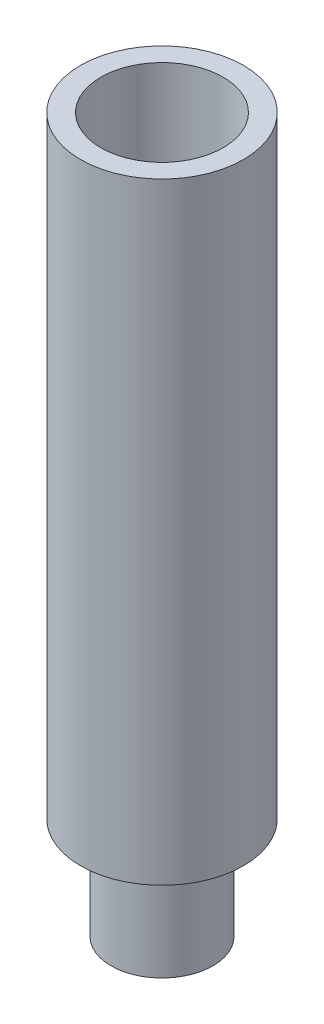
ISO-10303-21;
HEADER;
FILE_DESCRIPTION(('STEP AP214'),'2;1');
FILE_NAME('part.step','',(''),(''),'','','');
FILE_SCHEMA(('AUTOMOTIVE_DESIGN { 1 0 10303 214 1 1 1 1 }'));
ENDSEC;
DATA;
#1=APPLICATION_CONTEXT('core data for automotive mechanical design processes');
#2=APPLICATION_PROTOCOL_DEFINITION('international standard','automotive_design',2000,#1);
#3=PRODUCT_CONTEXT('',#1,'mechanical');
#4=PRODUCT('Part','Part','',(#3));
#5=PRODUCT_RELATED_PRODUCT_CATEGORY('part','',(#4));
#6=PRODUCT_DEFINITION_FORMATION('','',#4);
#7=PRODUCT_DEFINITION_CONTEXT('part definition',#1,'design');
#8=PRODUCT_DEFINITION('design','',#6,#7);
#9=PRODUCT_DEFINITION_SHAPE('','',#8);
#10=(LENGTH_UNIT() NAMED_UNIT(*) SI_UNIT(.MILLI.,.METRE.));
#11=(NAMED_UNIT(*) PLANE_ANGLE_UNIT() SI_UNIT($,.RADIAN.));
#12=(NAMED_UNIT(*) SI_UNIT($,.STERADIAN.) SOLID_ANGLE_UNIT());
#13=UNCERTAINTY_MEASURE_WITH_UNIT(LENGTH_MEASURE(1.E-05),#10,'distance_accuracy_value','');
#14=(GEOMETRIC_REPRESENTATION_CONTEXT(3) GLOBAL_UNCERTAINTY_ASSIGNED_CONTEXT((#13)) GLOBAL_UNIT_ASSIGNED_CONTEXT((#10,
#11,#12)) REPRESENTATION_CONTEXT('',''));
#15=CARTESIAN_POINT('',(0.,0.,0.));
#16=DIRECTION('',(0.,0.,1.));
#17=DIRECTION('',(1.,0.,0.));
#18=AXIS2_PLACEMENT_3D('',#15,#16,#17);
#19=CARTESIAN_POINT('',(0.,5.,0.));
#20=DIRECTION('',(0.,-1.,0.));
#21=DIRECTION('',(0.,0.,-1.));
#22=AXIS2_PLACEMENT_3D('',#19,#20,#21);
#23=CYLINDRICAL_SURFACE('',#22,2.5);
#24=CARTESIAN_POINT('',(0.,5.,0.));
#25=DIRECTION('',(0.,1.,0.));
#26=DIRECTION('',(0.,0.,1.));
#27=AXIS2_PLACEMENT_3D('',#24,#25,#26);
#28=CIRCLE('',#27,2.5);
#29=CARTESIAN_POINT('',(0.,5.,2.5));
#30=VERTEX_POINT('',#29);
#31=EDGE_CURVE('E54',#30,#30,#28,.T.);
#32=ORIENTED_EDGE('',*,*,#31,.F.);
#33=EDGE_LOOP('',(#32));
#34=FACE_BOUND('',#33,.T.);
#35=CARTESIAN_POINT('',(0.,0.,0.));
#36=DIRECTION('',(0.,1.,0.));
#37=DIRECTION('',(0.,0.,1.));
#38=AXIS2_PLACEMENT_3D('',#35,#36,#37);
#39=CIRCLE('',#38,2.5);
#40=CARTESIAN_POINT('',(0.,0.,2.5));
#41=VERTEX_POINT('',#40);
#42=EDGE_CURVE('E61',#41,#41,#39,.T.);
#43=ORIENTED_EDGE('',*,*,#42,.T.);
#44=EDGE_LOOP('',(#43));
#45=FACE_BOUND('',#44,.T.);
#46=ADVANCED_FACE('F47',(#34,#45),#23,.T.);
#47=CARTESIAN_POINT('',(0.,0.,0.));
#48=DIRECTION('',(0.,1.,0.));
#49=DIRECTION('',(0.,0.,1.));
#50=AXIS2_PLACEMENT_3D('',#47,#48,#49);
#51=PLANE('',#50);
#52=ORIENTED_EDGE('',*,*,#42,.F.);
#53=EDGE_LOOP('',(#52));
#54=FACE_BOUND('',#53,.T.);
#55=ADVANCED_FACE('F99',(#54),#51,.F.);
#56=CARTESIAN_POINT('',(0.,6.,0.));
#57=DIRECTION('',(0.,-1.,0.));
#58=DIRECTION('',(0.,0.,-1.));
#59=AXIS2_PLACEMENT_3D('',#56,#57,#58);
#60=CYLINDRICAL_SURFACE('',#59,4.);
#61=CARTESIAN_POINT('',(0.,5.,0.));
#62=DIRECTION('',(0.,1.,0.));
#63=DIRECTION('',(0.,0.,1.));
#64=AXIS2_PLACEMENT_3D('',#61,#62,#63);
#65=CIRCLE('',#64,4.);
#66=CARTESIAN_POINT('',(0.,5.,4.));
#67=VERTEX_POINT('',#66);
#68=EDGE_CURVE('E68',#67,#67,#65,.T.);
#69=ORIENTED_EDGE('',*,*,#68,.T.);
#70=EDGE_LOOP('',(#69));
#71=FACE_BOUND('',#70,.T.);
#72=CARTESIAN_POINT('',(0.,35.,0.));
#73=DIRECTION('',(0.,1.,0.));
#74=DIRECTION('',(0.,0.,1.));
#75=AXIS2_PLACEMENT_3D('',#72,#73,#74);
#76=CIRCLE('',#75,4.);
#77=CARTESIAN_POINT('',(0.,35.,4.));
#78=VERTEX_POINT('',#77);
#79=EDGE_CURVE('E73',#78,#78,#76,.T.);
#80=ORIENTED_EDGE('',*,*,#79,.F.);
#81=EDGE_LOOP('',(#80));
#82=FACE_BOUND('',#81,.T.);
#83=ADVANCED_FACE('F95',(#71,#82),#60,.T.);
#84=CARTESIAN_POINT('',(0.,5.,0.));
#85=DIRECTION('',(0.,1.,0.));
#86=DIRECTION('',(0.,0.,1.));
#87=AXIS2_PLACEMENT_3D('',#84,#85,#86);
#88=PLANE('',#87);
#89=ORIENTED_EDGE('',*,*,#31,.T.);
#90=EDGE_LOOP('',(#89));
#91=FACE_BOUND('',#90,.T.);
#92=ORIENTED_EDGE('',*,*,#68,.F.);
#93=EDGE_LOOP('',(#92));
#94=FACE_BOUND('',#93,.T.);
#95=ADVANCED_FACE('F86',(#91,#94),#88,.F.);
#96=CARTESIAN_POINT('',(0.,35.,0.));
#97=DIRECTION('',(0.,1.,0.));
#98=DIRECTION('',(0.,0.,1.));
#99=AXIS2_PLACEMENT_3D('',#96,#97,#98);
#100=PLANE('',#99);
#101=ORIENTED_EDGE('',*,*,#79,.T.);
#102=EDGE_LOOP('',(#101));
#103=FACE_BOUND('',#102,.T.);
#104=CARTESIAN_POINT('',(0.,35.,0.));
#105=DIRECTION('',(0.,1.,0.));
#106=DIRECTION('',(0.,0.,1.));
#107=AXIS2_PLACEMENT_3D('',#104,#105,#106);
#108=CIRCLE('',#107,3.);
#109=CARTESIAN_POINT('',(0.,35.,3.));
#110=VERTEX_POINT('',#109);
#111=EDGE_CURVE('E77',#110,#110,#108,.T.);
#112=ORIENTED_EDGE('',*,*,#111,.F.);
#113=EDGE_LOOP('',(#112));
#114=FACE_BOUND('',#113,.T.);
#115=ADVANCED_FACE('F84',(#103,#114),#100,.T.);
#116=CARTESIAN_POINT('',(0.,35.,0.));
#117=DIRECTION('',(0.,-1.,0.));
#118=DIRECTION('',(0.,0.,-1.));
#119=AXIS2_PLACEMENT_3D('',#116,#117,#118);
#120=CYLINDRICAL_SURFACE('',#119,3.);
#121=ORIENTED_EDGE('',*,*,#111,.T.);
#122=EDGE_LOOP('',(#121));
#123=FACE_BOUND('',#122,.T.);
#124=CARTESIAN_POINT('',(0.,6.,0.));
#125=DIRECTION('',(0.,1.,0.));
#126=DIRECTION('',(0.,0.,1.));
#127=AXIS2_PLACEMENT_3D('',#124,#125,#126);
#128=CIRCLE('',#127,3.);
#129=CARTESIAN_POINT('',(0.,6.,3.));
#130=VERTEX_POINT('',#129);
#131=EDGE_CURVE('E11',#130,#130,#128,.F.);
#132=ORIENTED_EDGE('',*,*,#131,.T.);
#133=EDGE_LOOP('',(#132));
#134=FACE_BOUND('',#133,.T.);
#135=ADVANCED_FACE('F82',(#123,#134),#120,.F.);
#136=CARTESIAN_POINT('',(0.,6.,0.));
#137=DIRECTION('',(0.,1.,0.));
#138=DIRECTION('',(0.,0.,1.));
#139=AXIS2_PLACEMENT_3D('',#136,#137,#138);
#140=PLANE('',#139);
#141=ORIENTED_EDGE('',*,*,#131,.F.);
#142=EDGE_LOOP('',(#141));
#143=FACE_BOUND('',#142,.T.);
#144=ADVANCED_FACE('F93',(#143),#140,.T.);
#145=CLOSED_SHELL('',(#46,#55,#83,#95,#115,#135,#144));
#146=MANIFOLD_SOLID_BREP('B2',#145);
#147=ADVANCED_BREP_SHAPE_REPRESENTATION('',(#18,#146),#14);
#148=SHAPE_DEFINITION_REPRESENTATION(#9,#147);
ENDSEC;
END-ISO-10303-21;
